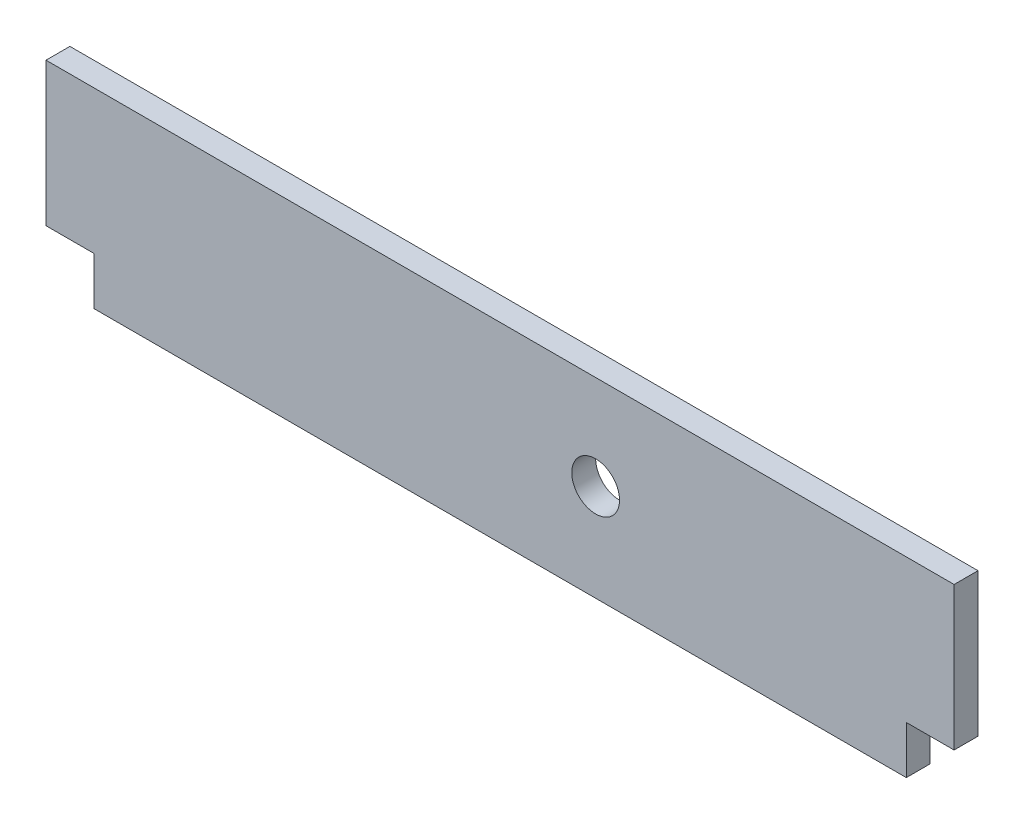
ISO-10303-21;
HEADER;
FILE_DESCRIPTION(('STEP AP214'),'2;1');
FILE_NAME('part.step','',(''),(''),'','','');
FILE_SCHEMA(('AUTOMOTIVE_DESIGN { 1 0 10303 214 1 1 1 1 }'));
ENDSEC;
DATA;
#1=APPLICATION_CONTEXT('core data for automotive mechanical design processes');
#2=APPLICATION_PROTOCOL_DEFINITION('international standard','automotive_design',2000,#1);
#3=PRODUCT_CONTEXT('',#1,'mechanical');
#4=PRODUCT('Part','Part','',(#3));
#5=PRODUCT_RELATED_PRODUCT_CATEGORY('part','',(#4));
#6=PRODUCT_DEFINITION_FORMATION('','',#4);
#7=PRODUCT_DEFINITION_CONTEXT('part definition',#1,'design');
#8=PRODUCT_DEFINITION('design','',#6,#7);
#9=PRODUCT_DEFINITION_SHAPE('','',#8);
#10=(LENGTH_UNIT() NAMED_UNIT(*) SI_UNIT(.MILLI.,.METRE.));
#11=(NAMED_UNIT(*) PLANE_ANGLE_UNIT() SI_UNIT($,.RADIAN.));
#12=(NAMED_UNIT(*) SI_UNIT($,.STERADIAN.) SOLID_ANGLE_UNIT());
#13=UNCERTAINTY_MEASURE_WITH_UNIT(LENGTH_MEASURE(1.E-05),#10,'distance_accuracy_value','');
#14=(GEOMETRIC_REPRESENTATION_CONTEXT(3) GLOBAL_UNCERTAINTY_ASSIGNED_CONTEXT((#13)) GLOBAL_UNIT_ASSIGNED_CONTEXT((#10,
#11,#12)) REPRESENTATION_CONTEXT('',''));
#15=CARTESIAN_POINT('',(0.,0.,0.));
#16=DIRECTION('',(0.,0.,1.));
#17=DIRECTION('',(1.,0.,0.));
#18=AXIS2_PLACEMENT_3D('',#15,#16,#17);
#19=CARTESIAN_POINT('',(215.9,0.,6.35));
#20=DIRECTION('',(-1.,0.,0.));
#21=DIRECTION('',(0.,-1.,0.));
#22=AXIS2_PLACEMENT_3D('',#19,#20,#21);
#23=PLANE('',#22);
#24=DIRECTION('',(0.,1.,0.));
#25=VECTOR('',#24,1.);
#26=CARTESIAN_POINT('',(215.9,0.,-6.35));
#27=LINE('',#26,#25);
#28=CARTESIAN_POINT('',(215.9,0.,-6.35));
#29=VERTEX_POINT('',#28);
#30=CARTESIAN_POINT('',(215.9,25.3999999999999,-6.35));
#31=VERTEX_POINT('',#30);
#32=EDGE_CURVE('E156',#29,#31,#27,.T.);
#33=ORIENTED_EDGE('',*,*,#32,.T.);
#34=DIRECTION('',(0.,0.,-1.));
#35=VECTOR('',#34,1.);
#36=CARTESIAN_POINT('',(215.9,25.3999999999999,6.35));
#37=LINE('',#36,#35);
#38=CARTESIAN_POINT('',(215.9,25.3999999999999,6.35));
#39=VERTEX_POINT('',#38);
#40=EDGE_CURVE('E138',#39,#31,#37,.T.);
#41=ORIENTED_EDGE('',*,*,#40,.F.);
#42=DIRECTION('',(0.,1.,0.));
#43=VECTOR('',#42,1.);
#44=CARTESIAN_POINT('',(215.9,0.,6.35));
#45=LINE('',#44,#43);
#46=CARTESIAN_POINT('',(215.9,0.,6.35));
#47=VERTEX_POINT('',#46);
#48=EDGE_CURVE('E176',#47,#39,#45,.T.);
#49=ORIENTED_EDGE('',*,*,#48,.F.);
#50=DIRECTION('',(0.,0.,-1.));
#51=VECTOR('',#50,1.);
#52=CARTESIAN_POINT('',(215.9,0.,6.35));
#53=LINE('',#52,#51);
#54=EDGE_CURVE('E141',#47,#29,#53,.T.);
#55=ORIENTED_EDGE('',*,*,#54,.T.);
#56=EDGE_LOOP('',(#33,#41,#49,#55));
#57=FACE_BOUND('',#56,.T.);
#58=ADVANCED_FACE('F46',(#57),#23,.F.);
#59=CARTESIAN_POINT('',(215.9,25.3999999999999,6.35));
#60=DIRECTION('',(0.,1.,0.));
#61=DIRECTION('',(-1.,0.,0.));
#62=AXIS2_PLACEMENT_3D('',#59,#60,#61);
#63=PLANE('',#62);
#64=DIRECTION('',(1.,0.,0.));
#65=VECTOR('',#64,1.);
#66=CARTESIAN_POINT('',(215.9,25.3999999999999,-6.35));
#67=LINE('',#66,#65);
#68=CARTESIAN_POINT('',(241.3,25.3999999999999,-6.35));
#69=VERTEX_POINT('',#68);
#70=EDGE_CURVE('E67',#31,#69,#67,.T.);
#71=ORIENTED_EDGE('',*,*,#70,.T.);
#72=DIRECTION('',(0.,0.,-1.));
#73=VECTOR('',#72,1.);
#74=CARTESIAN_POINT('',(241.3,25.3999999999999,6.35));
#75=LINE('',#74,#73);
#76=CARTESIAN_POINT('',(241.3,25.3999999999999,6.35));
#77=VERTEX_POINT('',#76);
#78=EDGE_CURVE('E135',#77,#69,#75,.T.);
#79=ORIENTED_EDGE('',*,*,#78,.F.);
#80=DIRECTION('',(1.,0.,0.));
#81=VECTOR('',#80,1.);
#82=CARTESIAN_POINT('',(215.9,25.3999999999999,6.35));
#83=LINE('',#82,#81);
#84=EDGE_CURVE('E100',#39,#77,#83,.T.);
#85=ORIENTED_EDGE('',*,*,#84,.F.);
#86=ORIENTED_EDGE('',*,*,#40,.T.);
#87=EDGE_LOOP('',(#71,#79,#85,#86));
#88=FACE_BOUND('',#87,.T.);
#89=ADVANCED_FACE('F134',(#88),#63,.F.);
#90=CARTESIAN_POINT('',(241.3,101.6,6.35));
#91=DIRECTION('',(-1.,0.,0.));
#92=DIRECTION('',(0.,-1.,0.));
#93=AXIS2_PLACEMENT_3D('',#90,#91,#92);
#94=PLANE('',#93);
#95=DIRECTION('',(0.,1.,0.));
#96=VECTOR('',#95,1.);
#97=CARTESIAN_POINT('',(241.3,101.6,-6.35));
#98=LINE('',#97,#96);
#99=CARTESIAN_POINT('',(241.3,101.6,-6.35));
#100=VERTEX_POINT('',#99);
#101=EDGE_CURVE('E131',#69,#100,#98,.T.);
#102=ORIENTED_EDGE('',*,*,#101,.T.);
#103=DIRECTION('',(0.,0.,-1.));
#104=VECTOR('',#103,1.);
#105=CARTESIAN_POINT('',(241.3,101.6,6.35));
#106=LINE('',#105,#104);
#107=CARTESIAN_POINT('',(241.3,101.6,6.35));
#108=VERTEX_POINT('',#107);
#109=EDGE_CURVE('E201',#108,#100,#106,.T.);
#110=ORIENTED_EDGE('',*,*,#109,.F.);
#111=DIRECTION('',(0.,1.,0.));
#112=VECTOR('',#111,1.);
#113=CARTESIAN_POINT('',(241.3,101.6,6.35));
#114=LINE('',#113,#112);
#115=EDGE_CURVE('E144',#77,#108,#114,.T.);
#116=ORIENTED_EDGE('',*,*,#115,.F.);
#117=ORIENTED_EDGE('',*,*,#78,.T.);
#118=EDGE_LOOP('',(#102,#110,#116,#117));
#119=FACE_BOUND('',#118,.T.);
#120=ADVANCED_FACE('F143',(#119),#94,.F.);
#121=CARTESIAN_POINT('',(-241.3,101.6,6.35));
#122=DIRECTION('',(0.,-1.,0.));
#123=DIRECTION('',(1.,0.,0.));
#124=AXIS2_PLACEMENT_3D('',#121,#122,#123);
#125=PLANE('',#124);
#126=DIRECTION('',(-1.,0.,0.));
#127=VECTOR('',#126,1.);
#128=CARTESIAN_POINT('',(-241.3,101.6,-6.35));
#129=LINE('',#128,#127);
#130=CARTESIAN_POINT('',(-241.3,101.6,-6.35));
#131=VERTEX_POINT('',#130);
#132=EDGE_CURVE('E145',#100,#131,#129,.T.);
#133=ORIENTED_EDGE('',*,*,#132,.T.);
#134=DIRECTION('',(0.,0.,-1.));
#135=VECTOR('',#134,1.);
#136=CARTESIAN_POINT('',(-241.3,101.6,6.35));
#137=LINE('',#136,#135);
#138=CARTESIAN_POINT('',(-241.3,101.6,6.35));
#139=VERTEX_POINT('',#138);
#140=EDGE_CURVE('E198',#139,#131,#137,.T.);
#141=ORIENTED_EDGE('',*,*,#140,.F.);
#142=DIRECTION('',(-1.,0.,0.));
#143=VECTOR('',#142,1.);
#144=CARTESIAN_POINT('',(-241.3,101.6,6.35));
#145=LINE('',#144,#143);
#146=EDGE_CURVE('E171',#108,#139,#145,.T.);
#147=ORIENTED_EDGE('',*,*,#146,.F.);
#148=ORIENTED_EDGE('',*,*,#109,.T.);
#149=EDGE_LOOP('',(#133,#141,#147,#148));
#150=FACE_BOUND('',#149,.T.);
#151=ADVANCED_FACE('F227',(#150),#125,.F.);
#152=CARTESIAN_POINT('',(-241.3,101.6,6.35));
#153=DIRECTION('',(1.,0.,0.));
#154=DIRECTION('',(0.,0.,-1.));
#155=AXIS2_PLACEMENT_3D('',#152,#153,#154);
#156=PLANE('',#155);
#157=DIRECTION('',(0.,-1.,0.));
#158=VECTOR('',#157,1.);
#159=CARTESIAN_POINT('',(-241.3,101.6,-6.35));
#160=LINE('',#159,#158);
#161=CARTESIAN_POINT('',(-241.3,25.4,-6.35));
#162=VERTEX_POINT('',#161);
#163=EDGE_CURVE('E199',#131,#162,#160,.T.);
#164=ORIENTED_EDGE('',*,*,#163,.T.);
#165=DIRECTION('',(0.,0.,-1.));
#166=VECTOR('',#165,1.);
#167=CARTESIAN_POINT('',(-241.3,25.4,6.35));
#168=LINE('',#167,#166);
#169=CARTESIAN_POINT('',(-241.3,25.4,6.35));
#170=VERTEX_POINT('',#169);
#171=EDGE_CURVE('E195',#170,#162,#168,.T.);
#172=ORIENTED_EDGE('',*,*,#171,.F.);
#173=DIRECTION('',(0.,-1.,0.));
#174=VECTOR('',#173,1.);
#175=CARTESIAN_POINT('',(-241.3,101.6,6.35));
#176=LINE('',#175,#174);
#177=EDGE_CURVE('E168',#139,#170,#176,.T.);
#178=ORIENTED_EDGE('',*,*,#177,.F.);
#179=ORIENTED_EDGE('',*,*,#140,.T.);
#180=EDGE_LOOP('',(#164,#172,#178,#179));
#181=FACE_BOUND('',#180,.T.);
#182=ADVANCED_FACE('F226',(#181),#156,.F.);
#183=CARTESIAN_POINT('',(-215.9,25.4,6.35));
#184=DIRECTION('',(0.,1.,0.));
#185=DIRECTION('',(0.,0.,1.));
#186=AXIS2_PLACEMENT_3D('',#183,#184,#185);
#187=PLANE('',#186);
#188=DIRECTION('',(1.,0.,0.));
#189=VECTOR('',#188,1.);
#190=CARTESIAN_POINT('',(-215.9,25.4,-6.35));
#191=LINE('',#190,#189);
#192=CARTESIAN_POINT('',(-215.9,25.4,-6.35));
#193=VERTEX_POINT('',#192);
#194=EDGE_CURVE('E196',#162,#193,#191,.T.);
#195=ORIENTED_EDGE('',*,*,#194,.T.);
#196=DIRECTION('',(0.,0.,-1.));
#197=VECTOR('',#196,1.);
#198=CARTESIAN_POINT('',(-215.9,25.4,6.35));
#199=LINE('',#198,#197);
#200=CARTESIAN_POINT('',(-215.9,25.4,6.35));
#201=VERTEX_POINT('',#200);
#202=EDGE_CURVE('E186',#201,#193,#199,.T.);
#203=ORIENTED_EDGE('',*,*,#202,.F.);
#204=DIRECTION('',(1.,0.,0.));
#205=VECTOR('',#204,1.);
#206=CARTESIAN_POINT('',(-215.9,25.4,6.35));
#207=LINE('',#206,#205);
#208=EDGE_CURVE('E165',#170,#201,#207,.T.);
#209=ORIENTED_EDGE('',*,*,#208,.F.);
#210=ORIENTED_EDGE('',*,*,#171,.T.);
#211=EDGE_LOOP('',(#195,#203,#209,#210));
#212=FACE_BOUND('',#211,.T.);
#213=ADVANCED_FACE('F216',(#212),#187,.F.);
#214=CARTESIAN_POINT('',(-215.9,25.4,6.35));
#215=DIRECTION('',(1.,0.,0.));
#216=DIRECTION('',(0.,0.,-1.));
#217=AXIS2_PLACEMENT_3D('',#214,#215,#216);
#218=PLANE('',#217);
#219=DIRECTION('',(0.,-1.,0.));
#220=VECTOR('',#219,1.);
#221=CARTESIAN_POINT('',(-215.9,25.4,-6.35));
#222=LINE('',#221,#220);
#223=CARTESIAN_POINT('',(-215.9,0.,-6.35));
#224=VERTEX_POINT('',#223);
#225=EDGE_CURVE('E193',#193,#224,#222,.T.);
#226=ORIENTED_EDGE('',*,*,#225,.T.);
#227=DIRECTION('',(0.,0.,-1.));
#228=VECTOR('',#227,1.);
#229=CARTESIAN_POINT('',(-215.9,0.,6.35));
#230=LINE('',#229,#228);
#231=CARTESIAN_POINT('',(-215.9,0.,6.35));
#232=VERTEX_POINT('',#231);
#233=EDGE_CURVE('E178',#232,#224,#230,.T.);
#234=ORIENTED_EDGE('',*,*,#233,.F.);
#235=DIRECTION('',(0.,-1.,0.));
#236=VECTOR('',#235,1.);
#237=CARTESIAN_POINT('',(-215.9,25.4,6.35));
#238=LINE('',#237,#236);
#239=EDGE_CURVE('E162',#201,#232,#238,.T.);
#240=ORIENTED_EDGE('',*,*,#239,.F.);
#241=ORIENTED_EDGE('',*,*,#202,.T.);
#242=EDGE_LOOP('',(#226,#234,#240,#241));
#243=FACE_BOUND('',#242,.T.);
#244=ADVANCED_FACE('F222',(#243),#218,.F.);
#245=CARTESIAN_POINT('',(-215.9,0.,6.35));
#246=DIRECTION('',(0.,1.,0.));
#247=DIRECTION('',(0.,0.,1.));
#248=AXIS2_PLACEMENT_3D('',#245,#246,#247);
#249=PLANE('',#248);
#250=DIRECTION('',(1.,0.,0.));
#251=VECTOR('',#250,1.);
#252=CARTESIAN_POINT('',(-215.9,0.,-6.35));
#253=LINE('',#252,#251);
#254=EDGE_CURVE('E111',#224,#29,#253,.T.);
#255=ORIENTED_EDGE('',*,*,#254,.T.);
#256=ORIENTED_EDGE('',*,*,#54,.F.);
#257=DIRECTION('',(1.,0.,0.));
#258=VECTOR('',#257,1.);
#259=CARTESIAN_POINT('',(-215.9,0.,6.35));
#260=LINE('',#259,#258);
#261=EDGE_CURVE('E159',#232,#47,#260,.T.);
#262=ORIENTED_EDGE('',*,*,#261,.F.);
#263=ORIENTED_EDGE('',*,*,#233,.T.);
#264=EDGE_LOOP('',(#255,#256,#262,#263));
#265=FACE_BOUND('',#264,.T.);
#266=ADVANCED_FACE('F243',(#265),#249,.F.);
#267=CARTESIAN_POINT('',(0.,0.,6.35));
#268=DIRECTION('',(0.,0.,-1.));
#269=DIRECTION('',(-1.,0.,0.));
#270=AXIS2_PLACEMENT_3D('',#267,#268,#269);
#271=PLANE('',#270);
#272=CARTESIAN_POINT('',(50.8000000000006,51.5000000000016,6.34999999999999));
#273=DIRECTION('',(0.,0.,-1.));
#274=DIRECTION('',(-1.,0.,0.));
#275=AXIS2_PLACEMENT_3D('',#272,#273,#274);
#276=CIRCLE('',#275,12.7000000000001);
#277=CARTESIAN_POINT('',(38.1000000000005,51.5000000000016,6.34999999999999));
#278=VERTEX_POINT('',#277);
#279=EDGE_CURVE('E11',#278,#278,#276,.F.);
#280=ORIENTED_EDGE('',*,*,#279,.F.);
#281=EDGE_LOOP('',(#280));
#282=FACE_BOUND('',#281,.T.);
#283=ORIENTED_EDGE('',*,*,#48,.T.);
#284=ORIENTED_EDGE('',*,*,#84,.T.);
#285=ORIENTED_EDGE('',*,*,#115,.T.);
#286=ORIENTED_EDGE('',*,*,#146,.T.);
#287=ORIENTED_EDGE('',*,*,#177,.T.);
#288=ORIENTED_EDGE('',*,*,#208,.T.);
#289=ORIENTED_EDGE('',*,*,#239,.T.);
#290=ORIENTED_EDGE('',*,*,#261,.T.);
#291=EDGE_LOOP('',(#283,#284,#285,#286,#287,#288,#289,#290));
#292=FACE_BOUND('',#291,.T.);
#293=ADVANCED_FACE('F48',(#282,#292),#271,.F.);
#294=CARTESIAN_POINT('',(0.,0.,-6.35));
#295=DIRECTION('',(0.,0.,-1.));
#296=DIRECTION('',(-1.,0.,0.));
#297=AXIS2_PLACEMENT_3D('',#294,#295,#296);
#298=PLANE('',#297);
#299=CARTESIAN_POINT('',(50.8000000000006,51.5000000000016,-6.34999999999999));
#300=DIRECTION('',(0.,0.,-1.));
#301=DIRECTION('',(-1.,0.,0.));
#302=AXIS2_PLACEMENT_3D('',#299,#300,#301);
#303=CIRCLE('',#302,12.7000000000001);
#304=CARTESIAN_POINT('',(38.1000000000005,51.5000000000016,-6.34999999999999));
#305=VERTEX_POINT('',#304);
#306=EDGE_CURVE('E56',#305,#305,#303,.F.);
#307=ORIENTED_EDGE('',*,*,#306,.T.);
#308=EDGE_LOOP('',(#307));
#309=FACE_BOUND('',#308,.T.);
#310=ORIENTED_EDGE('',*,*,#32,.F.);
#311=ORIENTED_EDGE('',*,*,#254,.F.);
#312=ORIENTED_EDGE('',*,*,#225,.F.);
#313=ORIENTED_EDGE('',*,*,#194,.F.);
#314=ORIENTED_EDGE('',*,*,#163,.F.);
#315=ORIENTED_EDGE('',*,*,#132,.F.);
#316=ORIENTED_EDGE('',*,*,#101,.F.);
#317=ORIENTED_EDGE('',*,*,#70,.F.);
#318=EDGE_LOOP('',(#310,#311,#312,#313,#314,#315,#316,#317));
#319=FACE_BOUND('',#318,.T.);
#320=ADVANCED_FACE('F148',(#309,#319),#298,.T.);
#321=CARTESIAN_POINT('',(50.8000000000006,51.5000000000017,-101.056542434233));
#322=DIRECTION('',(0.,0.,1.));
#323=DIRECTION('',(0.,-1.,0.));
#324=AXIS2_PLACEMENT_3D('',#321,#322,#323);
#325=CYLINDRICAL_SURFACE('',#324,12.7000000000001);
#326=ORIENTED_EDGE('',*,*,#306,.F.);
#327=EDGE_LOOP('',(#326));
#328=FACE_BOUND('',#327,.T.);
#329=ORIENTED_EDGE('',*,*,#279,.T.);
#330=EDGE_LOOP('',(#329));
#331=FACE_BOUND('',#330,.T.);
#332=ADVANCED_FACE('F254',(#328,#331),#325,.F.);
#333=CLOSED_SHELL('',(#58,#89,#120,#151,#182,#213,#244,#266,#293,#320,#332));
#334=MANIFOLD_SOLID_BREP('B2',#333);
#335=ADVANCED_BREP_SHAPE_REPRESENTATION('',(#18,#334),#14);
#336=SHAPE_DEFINITION_REPRESENTATION(#9,#335);
ENDSEC;
END-ISO-10303-21;
